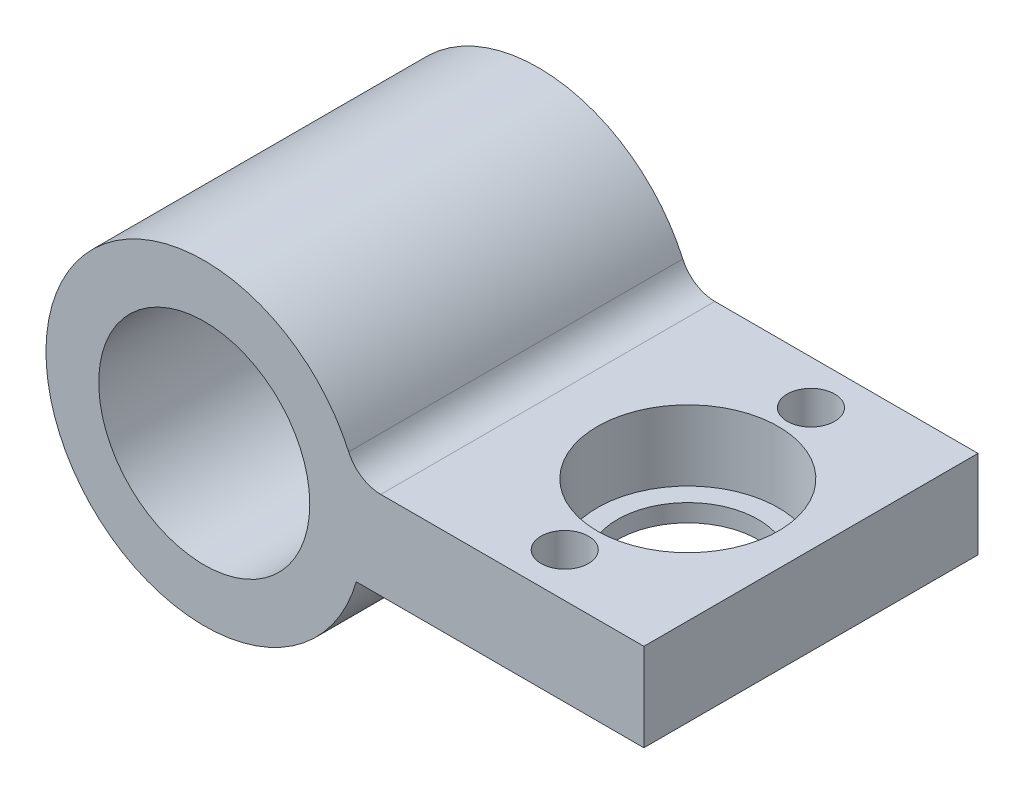
ISO-10303-21;
HEADER;
FILE_DESCRIPTION(('STEP AP214'),'2;1');
FILE_NAME('part.step','',(''),(''),'','','');
FILE_SCHEMA(('AUTOMOTIVE_DESIGN { 1 0 10303 214 1 1 1 1 }'));
ENDSEC;
DATA;
#1=APPLICATION_CONTEXT('core data for automotive mechanical design processes');
#2=APPLICATION_PROTOCOL_DEFINITION('international standard','automotive_design',2000,#1);
#3=PRODUCT_CONTEXT('',#1,'mechanical');
#4=PRODUCT('Part','Part','',(#3));
#5=PRODUCT_RELATED_PRODUCT_CATEGORY('part','',(#4));
#6=PRODUCT_DEFINITION_FORMATION('','',#4);
#7=PRODUCT_DEFINITION_CONTEXT('part definition',#1,'design');
#8=PRODUCT_DEFINITION('design','',#6,#7);
#9=PRODUCT_DEFINITION_SHAPE('','',#8);
#10=(LENGTH_UNIT() NAMED_UNIT(*) SI_UNIT(.MILLI.,.METRE.));
#11=(NAMED_UNIT(*) PLANE_ANGLE_UNIT() SI_UNIT($,.RADIAN.));
#12=(NAMED_UNIT(*) SI_UNIT($,.STERADIAN.) SOLID_ANGLE_UNIT());
#13=UNCERTAINTY_MEASURE_WITH_UNIT(LENGTH_MEASURE(1.E-05),#10,'distance_accuracy_value','');
#14=(GEOMETRIC_REPRESENTATION_CONTEXT(3) GLOBAL_UNCERTAINTY_ASSIGNED_CONTEXT((#13)) GLOBAL_UNIT_ASSIGNED_CONTEXT((#10,
#11,#12)) REPRESENTATION_CONTEXT('',''));
#15=CARTESIAN_POINT('',(0.,0.,0.));
#16=DIRECTION('',(0.,0.,1.));
#17=DIRECTION('',(1.,0.,0.));
#18=AXIS2_PLACEMENT_3D('',#15,#16,#17);
#19=CARTESIAN_POINT('',(18.,2.5,0.));
#20=DIRECTION('',(0.,-1.,0.));
#21=DIRECTION('',(0.,0.,-1.));
#22=AXIS2_PLACEMENT_3D('',#19,#20,#21);
#23=CYLINDRICAL_SURFACE('',#22,4.);
#24=CARTESIAN_POINT('',(18.,-2.5,0.));
#25=DIRECTION('',(0.,1.,0.));
#26=DIRECTION('',(0.,0.,1.));
#27=AXIS2_PLACEMENT_3D('',#24,#25,#26);
#28=CIRCLE('',#27,4.);
#29=CARTESIAN_POINT('',(18.,-2.5,4.));
#30=VERTEX_POINT('',#29);
#31=EDGE_CURVE('E180',#30,#30,#28,.T.);
#32=ORIENTED_EDGE('',*,*,#31,.F.);
#33=EDGE_LOOP('',(#32));
#34=FACE_BOUND('',#33,.T.);
#35=CARTESIAN_POINT('',(18.,-1.5,0.));
#36=DIRECTION('',(0.,1.,0.));
#37=DIRECTION('',(0.,0.,1.));
#38=AXIS2_PLACEMENT_3D('',#35,#36,#37);
#39=CIRCLE('',#38,4.);
#40=CARTESIAN_POINT('',(18.,-1.5,4.));
#41=VERTEX_POINT('',#40);
#42=EDGE_CURVE('E123',#41,#41,#39,.T.);
#43=ORIENTED_EDGE('',*,*,#42,.T.);
#44=EDGE_LOOP('',(#43));
#45=FACE_BOUND('',#44,.T.);
#46=ADVANCED_FACE('F33',(#34,#45),#23,.F.);
#47=CARTESIAN_POINT('',(0.,0.,9.5));
#48=DIRECTION('',(0.,0.,1.));
#49=DIRECTION('',(1.,0.,0.));
#50=AXIS2_PLACEMENT_3D('',#47,#48,#49);
#51=PLANE('',#50);
#52=CARTESIAN_POINT('',(0.,0.,9.5));
#53=DIRECTION('',(0.,0.,1.));
#54=DIRECTION('',(1.,0.,0.));
#55=AXIS2_PLACEMENT_3D('',#52,#53,#54);
#56=CIRCLE('',#55,6.);
#57=CARTESIAN_POINT('',(6.,0.,9.5));
#58=VERTEX_POINT('',#57);
#59=EDGE_CURVE('E113',#58,#58,#56,.T.);
#60=ORIENTED_EDGE('',*,*,#59,.F.);
#61=EDGE_LOOP('',(#60));
#62=FACE_BOUND('',#61,.T.);
#63=DIRECTION('',(1.,0.,0.));
#64=VECTOR('',#63,1.);
#65=CARTESIAN_POINT('',(0.,2.5,9.5));
#66=LINE('',#65,#64);
#67=CARTESIAN_POINT('',(10.0374299499424,2.5,9.5));
#68=VERTEX_POINT('',#67);
#69=CARTESIAN_POINT('',(25.,2.5,9.5));
#70=VERTEX_POINT('',#69);
#71=EDGE_CURVE('E76',#68,#70,#66,.T.);
#72=ORIENTED_EDGE('',*,*,#71,.F.);
#73=CARTESIAN_POINT('',(10.0374299499424,4.5,9.5));
#74=DIRECTION('',(0.,0.,1.));
#75=DIRECTION('',(1.,0.,0.));
#76=AXIS2_PLACEMENT_3D('',#73,#74,#75);
#77=CIRCLE('',#76,2.);
#78=CARTESIAN_POINT('',(8.21244268631648,3.68181818181818,9.5));
#79=VERTEX_POINT('',#78);
#80=EDGE_CURVE('E11',#68,#79,#77,.F.);
#81=ORIENTED_EDGE('',*,*,#80,.T.);
#82=CARTESIAN_POINT('',(0.,0.,9.5));
#83=DIRECTION('',(0.,0.,1.));
#84=DIRECTION('',(1.,0.,0.));
#85=AXIS2_PLACEMENT_3D('',#82,#83,#84);
#86=CIRCLE('',#85,9.);
#87=CARTESIAN_POINT('',(8.64580823289529,-2.5,9.5));
#88=VERTEX_POINT('',#87);
#89=EDGE_CURVE('E119',#79,#88,#86,.T.);
#90=ORIENTED_EDGE('',*,*,#89,.T.);
#91=DIRECTION('',(1.,0.,0.));
#92=VECTOR('',#91,1.);
#93=CARTESIAN_POINT('',(0.,-2.5,9.5));
#94=LINE('',#93,#92);
#95=CARTESIAN_POINT('',(25.,-2.5,9.5));
#96=VERTEX_POINT('',#95);
#97=EDGE_CURVE('E90',#88,#96,#94,.T.);
#98=ORIENTED_EDGE('',*,*,#97,.T.);
#99=DIRECTION('',(0.,-1.,0.));
#100=VECTOR('',#99,1.);
#101=CARTESIAN_POINT('',(25.,2.5,9.5));
#102=LINE('',#101,#100);
#103=EDGE_CURVE('E87',#70,#96,#102,.T.);
#104=ORIENTED_EDGE('',*,*,#103,.F.);
#105=EDGE_LOOP('',(#72,#81,#90,#98,#104));
#106=FACE_BOUND('',#105,.T.);
#107=ADVANCED_FACE('F88',(#62,#106),#51,.T.);
#108=CARTESIAN_POINT('',(0.,0.,-9.5));
#109=DIRECTION('',(0.,0.,1.));
#110=DIRECTION('',(1.,0.,0.));
#111=AXIS2_PLACEMENT_3D('',#108,#109,#110);
#112=PLANE('',#111);
#113=CARTESIAN_POINT('',(0.,0.,-9.5));
#114=DIRECTION('',(0.,0.,1.));
#115=DIRECTION('',(1.,0.,0.));
#116=AXIS2_PLACEMENT_3D('',#113,#114,#115);
#117=CIRCLE('',#116,6.);
#118=CARTESIAN_POINT('',(6.,0.,-9.5));
#119=VERTEX_POINT('',#118);
#120=EDGE_CURVE('E112',#119,#119,#117,.T.);
#121=ORIENTED_EDGE('',*,*,#120,.T.);
#122=EDGE_LOOP('',(#121));
#123=FACE_BOUND('',#122,.T.);
#124=CARTESIAN_POINT('',(0.,0.,-9.5));
#125=DIRECTION('',(0.,0.,1.));
#126=DIRECTION('',(1.,0.,0.));
#127=AXIS2_PLACEMENT_3D('',#124,#125,#126);
#128=CIRCLE('',#127,9.);
#129=CARTESIAN_POINT('',(8.21244268631648,3.68181818181818,-9.5));
#130=VERTEX_POINT('',#129);
#131=CARTESIAN_POINT('',(8.64580823289529,-2.5,-9.5));
#132=VERTEX_POINT('',#131);
#133=EDGE_CURVE('E116',#130,#132,#128,.T.);
#134=ORIENTED_EDGE('',*,*,#133,.F.);
#135=CARTESIAN_POINT('',(10.0374299499424,4.5,-9.5));
#136=DIRECTION('',(0.,0.,1.));
#137=DIRECTION('',(1.,0.,0.));
#138=AXIS2_PLACEMENT_3D('',#135,#136,#137);
#139=CIRCLE('',#138,2.);
#140=CARTESIAN_POINT('',(10.0374299499424,2.5,-9.5));
#141=VERTEX_POINT('',#140);
#142=EDGE_CURVE('E41',#130,#141,#139,.T.);
#143=ORIENTED_EDGE('',*,*,#142,.T.);
#144=DIRECTION('',(-1.,0.,0.));
#145=VECTOR('',#144,1.);
#146=CARTESIAN_POINT('',(0.,2.5,-9.5));
#147=LINE('',#146,#145);
#148=CARTESIAN_POINT('',(25.,2.5,-9.5));
#149=VERTEX_POINT('',#148);
#150=EDGE_CURVE('E98',#149,#141,#147,.T.);
#151=ORIENTED_EDGE('',*,*,#150,.F.);
#152=DIRECTION('',(0.,-1.,0.));
#153=VECTOR('',#152,1.);
#154=CARTESIAN_POINT('',(25.,2.5,-9.5));
#155=LINE('',#154,#153);
#156=CARTESIAN_POINT('',(25.,-2.5,-9.5));
#157=VERTEX_POINT('',#156);
#158=EDGE_CURVE('E94',#149,#157,#155,.T.);
#159=ORIENTED_EDGE('',*,*,#158,.T.);
#160=DIRECTION('',(-1.,0.,0.));
#161=VECTOR('',#160,1.);
#162=CARTESIAN_POINT('',(0.,-2.5,-9.5));
#163=LINE('',#162,#161);
#164=EDGE_CURVE('E84',#157,#132,#163,.T.);
#165=ORIENTED_EDGE('',*,*,#164,.T.);
#166=EDGE_LOOP('',(#134,#143,#151,#159,#165));
#167=FACE_BOUND('',#166,.T.);
#168=ADVANCED_FACE('F136',(#123,#167),#112,.F.);
#169=CARTESIAN_POINT('',(0.,0.,9.5));
#170=DIRECTION('',(0.,0.,-1.));
#171=DIRECTION('',(-1.,0.,0.));
#172=AXIS2_PLACEMENT_3D('',#169,#170,#171);
#173=CYLINDRICAL_SURFACE('',#172,9.);
#174=ORIENTED_EDGE('',*,*,#89,.F.);
#175=DIRECTION('',(0.,0.,-1.));
#176=VECTOR('',#175,1.);
#177=CARTESIAN_POINT('',(8.21244268631648,3.68181818181818,9.5));
#178=LINE('',#177,#176);
#179=EDGE_CURVE('E121',#79,#130,#178,.T.);
#180=ORIENTED_EDGE('',*,*,#179,.T.);
#181=ORIENTED_EDGE('',*,*,#133,.T.);
#182=DIRECTION('',(0.,0.,-1.));
#183=VECTOR('',#182,1.);
#184=CARTESIAN_POINT('',(8.64580823289529,-2.5,9.5));
#185=LINE('',#184,#183);
#186=EDGE_CURVE('E93',#88,#132,#185,.T.);
#187=ORIENTED_EDGE('',*,*,#186,.F.);
#188=EDGE_LOOP('',(#174,#180,#181,#187));
#189=FACE_BOUND('',#188,.T.);
#190=ADVANCED_FACE('F133',(#189),#173,.T.);
#191=CARTESIAN_POINT('',(0.,0.,9.5));
#192=DIRECTION('',(0.,0.,-1.));
#193=DIRECTION('',(-1.,0.,0.));
#194=AXIS2_PLACEMENT_3D('',#191,#192,#193);
#195=CYLINDRICAL_SURFACE('',#194,6.);
#196=ORIENTED_EDGE('',*,*,#120,.F.);
#197=EDGE_LOOP('',(#196));
#198=FACE_BOUND('',#197,.T.);
#199=ORIENTED_EDGE('',*,*,#59,.T.);
#200=EDGE_LOOP('',(#199));
#201=FACE_BOUND('',#200,.T.);
#202=ADVANCED_FACE('F149',(#198,#201),#195,.F.);
#203=CARTESIAN_POINT('',(0.,2.5,0.));
#204=DIRECTION('',(0.,1.,0.));
#205=DIRECTION('',(0.,0.,1.));
#206=AXIS2_PLACEMENT_3D('',#203,#204,#205);
#207=PLANE('',#206);
#208=CARTESIAN_POINT('',(18.,2.5,0.));
#209=DIRECTION('',(0.,1.,0.));
#210=DIRECTION('',(0.,0.,1.));
#211=AXIS2_PLACEMENT_3D('',#208,#209,#210);
#212=CIRCLE('',#211,5.15);
#213=CARTESIAN_POINT('',(18.,2.5,5.15));
#214=VERTEX_POINT('',#213);
#215=EDGE_CURVE('E190',#214,#214,#212,.T.);
#216=ORIENTED_EDGE('',*,*,#215,.F.);
#217=EDGE_LOOP('',(#216));
#218=FACE_BOUND('',#217,.T.);
#219=CARTESIAN_POINT('',(18.,2.5,7.));
#220=DIRECTION('',(0.,1.,0.));
#221=DIRECTION('',(0.,0.,1.));
#222=AXIS2_PLACEMENT_3D('',#219,#220,#221);
#223=CIRCLE('',#222,1.35);
#224=CARTESIAN_POINT('',(18.,2.5,8.35));
#225=VERTEX_POINT('',#224);
#226=EDGE_CURVE('E105',#225,#225,#223,.T.);
#227=ORIENTED_EDGE('',*,*,#226,.F.);
#228=EDGE_LOOP('',(#227));
#229=FACE_BOUND('',#228,.T.);
#230=CARTESIAN_POINT('',(18.,2.5,-7.));
#231=DIRECTION('',(0.,1.,0.));
#232=DIRECTION('',(0.,0.,1.));
#233=AXIS2_PLACEMENT_3D('',#230,#231,#232);
#234=CIRCLE('',#233,1.35);
#235=CARTESIAN_POINT('',(18.,2.5,-5.65));
#236=VERTEX_POINT('',#235);
#237=EDGE_CURVE('E183',#236,#236,#234,.T.);
#238=ORIENTED_EDGE('',*,*,#237,.F.);
#239=EDGE_LOOP('',(#238));
#240=FACE_BOUND('',#239,.T.);
#241=ORIENTED_EDGE('',*,*,#150,.T.);
#242=DIRECTION('',(0.,0.,-1.));
#243=VECTOR('',#242,1.);
#244=CARTESIAN_POINT('',(10.0374299499424,2.5,0.));
#245=LINE('',#244,#243);
#246=EDGE_CURVE('E54',#141,#68,#245,.F.);
#247=ORIENTED_EDGE('',*,*,#246,.T.);
#248=ORIENTED_EDGE('',*,*,#71,.T.);
#249=DIRECTION('',(0.,0.,-1.));
#250=VECTOR('',#249,1.);
#251=CARTESIAN_POINT('',(25.,2.5,-9.5));
#252=LINE('',#251,#250);
#253=EDGE_CURVE('E80',#70,#149,#252,.T.);
#254=ORIENTED_EDGE('',*,*,#253,.T.);
#255=EDGE_LOOP('',(#241,#247,#248,#254));
#256=FACE_BOUND('',#255,.T.);
#257=ADVANCED_FACE('F78',(#218,#229,#240,#256),#207,.T.);
#258=CARTESIAN_POINT('',(0.,-2.5,0.));
#259=DIRECTION('',(0.,1.,0.));
#260=DIRECTION('',(0.,0.,1.));
#261=AXIS2_PLACEMENT_3D('',#258,#259,#260);
#262=PLANE('',#261);
#263=CARTESIAN_POINT('',(18.,-2.5,7.));
#264=DIRECTION('',(0.,1.,0.));
#265=DIRECTION('',(0.,0.,1.));
#266=AXIS2_PLACEMENT_3D('',#263,#264,#265);
#267=CIRCLE('',#266,1.35);
#268=CARTESIAN_POINT('',(18.,-2.5,8.35));
#269=VERTEX_POINT('',#268);
#270=EDGE_CURVE('E179',#269,#269,#267,.T.);
#271=ORIENTED_EDGE('',*,*,#270,.T.);
#272=EDGE_LOOP('',(#271));
#273=FACE_BOUND('',#272,.T.);
#274=ORIENTED_EDGE('',*,*,#31,.T.);
#275=EDGE_LOOP('',(#274));
#276=FACE_BOUND('',#275,.T.);
#277=CARTESIAN_POINT('',(18.,-2.5,-7.));
#278=DIRECTION('',(0.,1.,0.));
#279=DIRECTION('',(0.,0.,1.));
#280=AXIS2_PLACEMENT_3D('',#277,#278,#279);
#281=CIRCLE('',#280,1.35);
#282=CARTESIAN_POINT('',(18.,-2.5,-5.65));
#283=VERTEX_POINT('',#282);
#284=EDGE_CURVE('E126',#283,#283,#281,.T.);
#285=ORIENTED_EDGE('',*,*,#284,.T.);
#286=EDGE_LOOP('',(#285));
#287=FACE_BOUND('',#286,.T.);
#288=ORIENTED_EDGE('',*,*,#97,.F.);
#289=ORIENTED_EDGE('',*,*,#186,.T.);
#290=ORIENTED_EDGE('',*,*,#164,.F.);
#291=DIRECTION('',(0.,0.,-1.));
#292=VECTOR('',#291,1.);
#293=CARTESIAN_POINT('',(25.,-2.5,-9.5));
#294=LINE('',#293,#292);
#295=EDGE_CURVE('E104',#96,#157,#294,.T.);
#296=ORIENTED_EDGE('',*,*,#295,.F.);
#297=EDGE_LOOP('',(#288,#289,#290,#296));
#298=FACE_BOUND('',#297,.T.);
#299=ADVANCED_FACE('F139',(#273,#276,#287,#298),#262,.F.);
#300=CARTESIAN_POINT('',(25.,2.5,-9.5));
#301=DIRECTION('',(-1.,0.,0.));
#302=DIRECTION('',(0.,0.,1.));
#303=AXIS2_PLACEMENT_3D('',#300,#301,#302);
#304=PLANE('',#303);
#305=ORIENTED_EDGE('',*,*,#295,.T.);
#306=ORIENTED_EDGE('',*,*,#158,.F.);
#307=ORIENTED_EDGE('',*,*,#253,.F.);
#308=ORIENTED_EDGE('',*,*,#103,.T.);
#309=EDGE_LOOP('',(#305,#306,#307,#308));
#310=FACE_BOUND('',#309,.T.);
#311=ADVANCED_FACE('F96',(#310),#304,.F.);
#312=CARTESIAN_POINT('',(18.,2.5,7.));
#313=DIRECTION('',(0.,-1.,0.));
#314=DIRECTION('',(0.,0.,-1.));
#315=AXIS2_PLACEMENT_3D('',#312,#313,#314);
#316=CYLINDRICAL_SURFACE('',#315,1.35);
#317=ORIENTED_EDGE('',*,*,#226,.T.);
#318=EDGE_LOOP('',(#317));
#319=FACE_BOUND('',#318,.T.);
#320=ORIENTED_EDGE('',*,*,#270,.F.);
#321=EDGE_LOOP('',(#320));
#322=FACE_BOUND('',#321,.T.);
#323=ADVANCED_FACE('F147',(#319,#322),#316,.F.);
#324=CARTESIAN_POINT('',(18.,2.5,-7.));
#325=DIRECTION('',(0.,-1.,0.));
#326=DIRECTION('',(0.,0.,-1.));
#327=AXIS2_PLACEMENT_3D('',#324,#325,#326);
#328=CYLINDRICAL_SURFACE('',#327,1.35);
#329=ORIENTED_EDGE('',*,*,#237,.T.);
#330=EDGE_LOOP('',(#329));
#331=FACE_BOUND('',#330,.T.);
#332=ORIENTED_EDGE('',*,*,#284,.F.);
#333=EDGE_LOOP('',(#332));
#334=FACE_BOUND('',#333,.T.);
#335=ADVANCED_FACE('F166',(#331,#334),#328,.F.);
#336=CARTESIAN_POINT('',(18.,-1.5,0.));
#337=DIRECTION('',(0.,1.,0.));
#338=DIRECTION('',(0.,0.,1.));
#339=AXIS2_PLACEMENT_3D('',#336,#337,#338);
#340=CYLINDRICAL_SURFACE('',#339,5.15);
#341=CARTESIAN_POINT('',(18.,-1.5,0.));
#342=DIRECTION('',(0.,1.,0.));
#343=DIRECTION('',(0.,0.,1.));
#344=AXIS2_PLACEMENT_3D('',#341,#342,#343);
#345=CIRCLE('',#344,5.15);
#346=CARTESIAN_POINT('',(18.,-1.5,5.15));
#347=VERTEX_POINT('',#346);
#348=EDGE_CURVE('E127',#347,#347,#345,.T.);
#349=ORIENTED_EDGE('',*,*,#348,.F.);
#350=EDGE_LOOP('',(#349));
#351=FACE_BOUND('',#350,.T.);
#352=ORIENTED_EDGE('',*,*,#215,.T.);
#353=EDGE_LOOP('',(#352));
#354=FACE_BOUND('',#353,.T.);
#355=ADVANCED_FACE('F173',(#351,#354),#340,.F.);
#356=CARTESIAN_POINT('',(18.,-1.5,0.));
#357=DIRECTION('',(0.,1.,0.));
#358=DIRECTION('',(0.,0.,1.));
#359=AXIS2_PLACEMENT_3D('',#356,#357,#358);
#360=PLANE('',#359);
#361=ORIENTED_EDGE('',*,*,#42,.F.);
#362=EDGE_LOOP('',(#361));
#363=FACE_BOUND('',#362,.T.);
#364=ORIENTED_EDGE('',*,*,#348,.T.);
#365=EDGE_LOOP('',(#364));
#366=FACE_BOUND('',#365,.T.);
#367=ADVANCED_FACE('F196',(#363,#366),#360,.T.);
#368=CARTESIAN_POINT('',(10.0374299499424,4.5,9.5));
#369=DIRECTION('',(0.,0.,-1.));
#370=DIRECTION('',(-1.,0.,0.));
#371=AXIS2_PLACEMENT_3D('',#368,#369,#370);
#372=CYLINDRICAL_SURFACE('',#371,2.);
#373=ORIENTED_EDGE('',*,*,#80,.F.);
#374=ORIENTED_EDGE('',*,*,#246,.F.);
#375=ORIENTED_EDGE('',*,*,#142,.F.);
#376=ORIENTED_EDGE('',*,*,#179,.F.);
#377=EDGE_LOOP('',(#373,#374,#375,#376));
#378=FACE_BOUND('',#377,.T.);
#379=ADVANCED_FACE('F35',(#378),#372,.F.);
#380=CLOSED_SHELL('',(#46,#107,#168,#190,#202,#257,#299,#311,#323,#335,#355,#367,#379));
#381=MANIFOLD_SOLID_BREP('B2',#380);
#382=ADVANCED_BREP_SHAPE_REPRESENTATION('',(#18,#381),#14);
#383=SHAPE_DEFINITION_REPRESENTATION(#9,#382);
ENDSEC;
END-ISO-10303-21;
